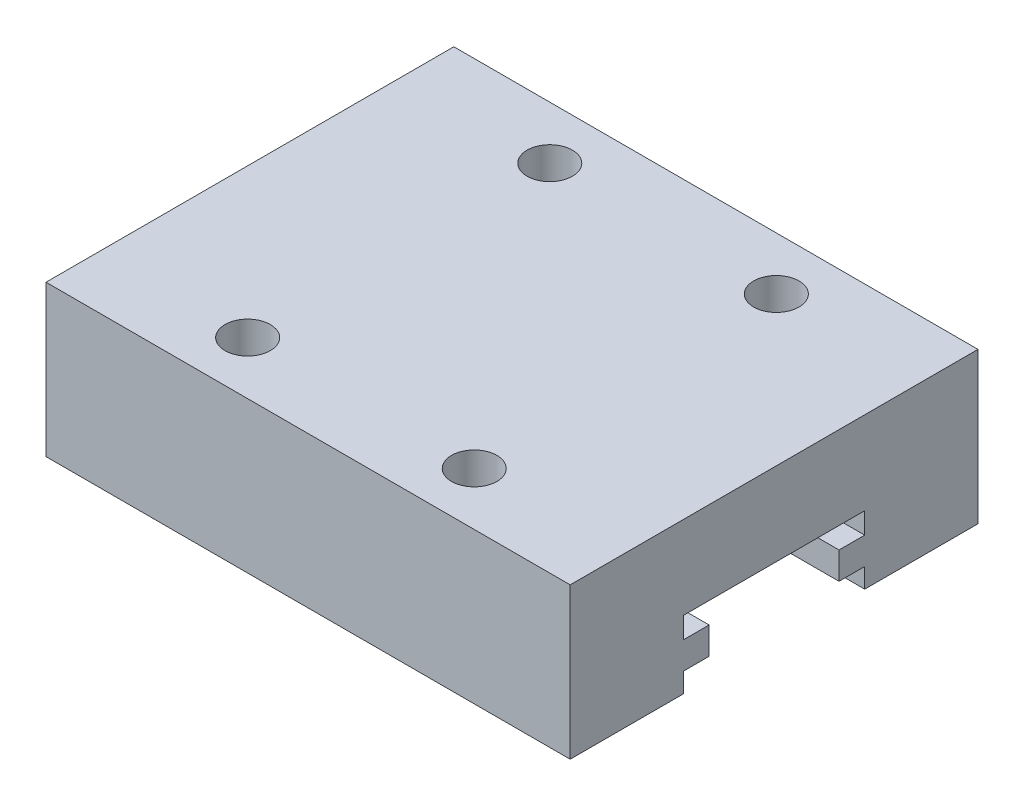
ISO-10303-21;
HEADER;
FILE_DESCRIPTION(('STEP AP214'),'2;1');
FILE_NAME('part.step','',(''),(''),'','','');
FILE_SCHEMA(('AUTOMOTIVE_DESIGN { 1 0 10303 214 1 1 1 1 }'));
ENDSEC;
DATA;
#1=APPLICATION_CONTEXT('core data for automotive mechanical design processes');
#2=APPLICATION_PROTOCOL_DEFINITION('international standard','automotive_design',2000,#1);
#3=PRODUCT_CONTEXT('',#1,'mechanical');
#4=PRODUCT('Part','Part','',(#3));
#5=PRODUCT_RELATED_PRODUCT_CATEGORY('part','',(#4));
#6=PRODUCT_DEFINITION_FORMATION('','',#4);
#7=PRODUCT_DEFINITION_CONTEXT('part definition',#1,'design');
#8=PRODUCT_DEFINITION('design','',#6,#7);
#9=PRODUCT_DEFINITION_SHAPE('','',#8);
#10=(LENGTH_UNIT() NAMED_UNIT(*) SI_UNIT(.MILLI.,.METRE.));
#11=(NAMED_UNIT(*) PLANE_ANGLE_UNIT() SI_UNIT($,.RADIAN.));
#12=(NAMED_UNIT(*) SI_UNIT($,.STERADIAN.) SOLID_ANGLE_UNIT());
#13=UNCERTAINTY_MEASURE_WITH_UNIT(LENGTH_MEASURE(1.E-05),#10,'distance_accuracy_value','');
#14=(GEOMETRIC_REPRESENTATION_CONTEXT(3) GLOBAL_UNCERTAINTY_ASSIGNED_CONTEXT((#13)) GLOBAL_UNIT_ASSIGNED_CONTEXT((#10,
#11,#12)) REPRESENTATION_CONTEXT('',''));
#15=CARTESIAN_POINT('',(0.,0.,0.));
#16=DIRECTION('',(0.,0.,1.));
#17=DIRECTION('',(1.,0.,0.));
#18=AXIS2_PLACEMENT_3D('',#15,#16,#17);
#19=CARTESIAN_POINT('',(0.,0.,0.));
#20=DIRECTION('',(0.,-1.,0.));
#21=DIRECTION('',(0.,0.,-1.));
#22=AXIS2_PLACEMENT_3D('',#19,#20,#21);
#23=PLANE('',#22);
#24=DIRECTION('',(1.,0.,0.));
#25=VECTOR('',#24,1.);
#26=CARTESIAN_POINT('',(-12.8160056179763,0.,-7.5));
#27=LINE('',#26,#25);
#28=CARTESIAN_POINT('',(0.,0.,-7.5));
#29=VERTEX_POINT('',#28);
#30=CARTESIAN_POINT('',(34.7,0.,-7.5));
#31=VERTEX_POINT('',#30);
#32=EDGE_CURVE('E159',#29,#31,#27,.T.);
#33=ORIENTED_EDGE('',*,*,#32,.T.);
#34=DIRECTION('',(0.,0.,-1.));
#35=VECTOR('',#34,1.);
#36=CARTESIAN_POINT('',(34.7,0.,0.));
#37=LINE('',#36,#35);
#38=CARTESIAN_POINT('',(34.7,0.,0.));
#39=VERTEX_POINT('',#38);
#40=EDGE_CURVE('E173',#39,#31,#37,.T.);
#41=ORIENTED_EDGE('',*,*,#40,.F.);
#42=DIRECTION('',(1.,0.,0.));
#43=VECTOR('',#42,1.);
#44=CARTESIAN_POINT('',(0.,0.,0.));
#45=LINE('',#44,#43);
#46=CARTESIAN_POINT('',(0.,0.,0.));
#47=VERTEX_POINT('',#46);
#48=EDGE_CURVE('E185',#47,#39,#45,.T.);
#49=ORIENTED_EDGE('',*,*,#48,.F.);
#50=DIRECTION('',(0.,0.,1.));
#51=VECTOR('',#50,1.);
#52=CARTESIAN_POINT('',(0.,0.,0.));
#53=LINE('',#52,#51);
#54=EDGE_CURVE('E174',#29,#47,#53,.T.);
#55=ORIENTED_EDGE('',*,*,#54,.F.);
#56=EDGE_LOOP('',(#33,#41,#49,#55));
#57=FACE_BOUND('',#56,.T.);
#58=ADVANCED_FACE('F34',(#57),#23,.T.);
#59=CARTESIAN_POINT('',(0.,10.,0.));
#60=DIRECTION('',(1.,0.,0.));
#61=DIRECTION('',(0.,0.,-1.));
#62=AXIS2_PLACEMENT_3D('',#59,#60,#61);
#63=PLANE('',#62);
#64=DIRECTION('',(0.,0.,-1.));
#65=VECTOR('',#64,1.);
#66=CARTESIAN_POINT('',(0.,1.3,-7.5));
#67=LINE('',#66,#65);
#68=CARTESIAN_POINT('',(0.,1.3,-7.5));
#69=VERTEX_POINT('',#68);
#70=CARTESIAN_POINT('',(0.,1.3,-9.2));
#71=VERTEX_POINT('',#70);
#72=EDGE_CURVE('E280',#69,#71,#67,.T.);
#73=ORIENTED_EDGE('',*,*,#72,.F.);
#74=DIRECTION('',(0.,1.,0.));
#75=VECTOR('',#74,1.);
#76=CARTESIAN_POINT('',(0.,0.,-7.5));
#77=LINE('',#76,#75);
#78=EDGE_CURVE('E229',#29,#69,#77,.T.);
#79=ORIENTED_EDGE('',*,*,#78,.F.);
#80=ORIENTED_EDGE('',*,*,#54,.T.);
#81=DIRECTION('',(0.,-1.,0.));
#82=VECTOR('',#81,1.);
#83=CARTESIAN_POINT('',(0.,10.,0.));
#84=LINE('',#83,#82);
#85=CARTESIAN_POINT('',(0.,10.,0.));
#86=VERTEX_POINT('',#85);
#87=EDGE_CURVE('E11',#86,#47,#84,.T.);
#88=ORIENTED_EDGE('',*,*,#87,.F.);
#89=DIRECTION('',(0.,0.,1.));
#90=VECTOR('',#89,1.);
#91=CARTESIAN_POINT('',(0.,10.,0.));
#92=LINE('',#91,#90);
#93=CARTESIAN_POINT('',(0.,10.,-27.));
#94=VERTEX_POINT('',#93);
#95=EDGE_CURVE('E183',#94,#86,#92,.T.);
#96=ORIENTED_EDGE('',*,*,#95,.F.);
#97=DIRECTION('',(0.,-1.,0.));
#98=VECTOR('',#97,1.);
#99=CARTESIAN_POINT('',(0.,10.,-27.));
#100=LINE('',#99,#98);
#101=CARTESIAN_POINT('',(0.,0.,-27.));
#102=VERTEX_POINT('',#101);
#103=EDGE_CURVE('E189',#94,#102,#100,.T.);
#104=ORIENTED_EDGE('',*,*,#103,.T.);
#105=CARTESIAN_POINT('',(0.,0.,-19.5));
#106=VERTEX_POINT('',#105);
#107=EDGE_CURVE('E199',#102,#106,#53,.T.);
#108=ORIENTED_EDGE('',*,*,#107,.T.);
#109=DIRECTION('',(0.,-1.,0.));
#110=VECTOR('',#109,1.);
#111=CARTESIAN_POINT('',(0.,0.,-19.5));
#112=LINE('',#111,#110);
#113=CARTESIAN_POINT('',(0.,1.3,-19.5));
#114=VERTEX_POINT('',#113);
#115=EDGE_CURVE('E49',#114,#106,#112,.T.);
#116=ORIENTED_EDGE('',*,*,#115,.F.);
#117=DIRECTION('',(0.,0.,-1.));
#118=VECTOR('',#117,1.);
#119=CARTESIAN_POINT('',(0.,1.3,-19.5));
#120=LINE('',#119,#118);
#121=CARTESIAN_POINT('',(0.,1.3,-17.8));
#122=VERTEX_POINT('',#121);
#123=EDGE_CURVE('E296',#122,#114,#120,.T.);
#124=ORIENTED_EDGE('',*,*,#123,.F.);
#125=DIRECTION('',(0.,-1.,0.));
#126=VECTOR('',#125,1.);
#127=CARTESIAN_POINT('',(0.,3.1,-17.8));
#128=LINE('',#127,#126);
#129=CARTESIAN_POINT('',(0.,3.1,-17.8));
#130=VERTEX_POINT('',#129);
#131=EDGE_CURVE('E294',#130,#122,#128,.T.);
#132=ORIENTED_EDGE('',*,*,#131,.F.);
#133=DIRECTION('',(0.,0.,1.));
#134=VECTOR('',#133,1.);
#135=CARTESIAN_POINT('',(0.,3.1,-19.5));
#136=LINE('',#135,#134);
#137=CARTESIAN_POINT('',(0.,3.1,-19.5));
#138=VERTEX_POINT('',#137);
#139=EDGE_CURVE('E292',#138,#130,#136,.T.);
#140=ORIENTED_EDGE('',*,*,#139,.F.);
#141=DIRECTION('',(0.,-1.,0.));
#142=VECTOR('',#141,1.);
#143=CARTESIAN_POINT('',(0.,3.1,-19.5));
#144=LINE('',#143,#142);
#145=CARTESIAN_POINT('',(0.,4.5,-19.5));
#146=VERTEX_POINT('',#145);
#147=EDGE_CURVE('E290',#146,#138,#144,.T.);
#148=ORIENTED_EDGE('',*,*,#147,.F.);
#149=DIRECTION('',(0.,0.,-1.));
#150=VECTOR('',#149,1.);
#151=CARTESIAN_POINT('',(0.,4.5,-7.5));
#152=LINE('',#151,#150);
#153=CARTESIAN_POINT('',(0.,4.5,-7.5));
#154=VERTEX_POINT('',#153);
#155=EDGE_CURVE('E288',#154,#146,#152,.T.);
#156=ORIENTED_EDGE('',*,*,#155,.F.);
#157=DIRECTION('',(0.,1.,0.));
#158=VECTOR('',#157,1.);
#159=CARTESIAN_POINT('',(0.,3.1,-7.5));
#160=LINE('',#159,#158);
#161=CARTESIAN_POINT('',(0.,3.1,-7.5));
#162=VERTEX_POINT('',#161);
#163=EDGE_CURVE('E286',#162,#154,#160,.T.);
#164=ORIENTED_EDGE('',*,*,#163,.F.);
#165=DIRECTION('',(0.,0.,1.));
#166=VECTOR('',#165,1.);
#167=CARTESIAN_POINT('',(0.,3.1,-7.5));
#168=LINE('',#167,#166);
#169=CARTESIAN_POINT('',(0.,3.1,-9.2));
#170=VERTEX_POINT('',#169);
#171=EDGE_CURVE('E284',#170,#162,#168,.T.);
#172=ORIENTED_EDGE('',*,*,#171,.F.);
#173=DIRECTION('',(0.,1.,0.));
#174=VECTOR('',#173,1.);
#175=CARTESIAN_POINT('',(0.,3.1,-9.2));
#176=LINE('',#175,#174);
#177=EDGE_CURVE('E282',#71,#170,#176,.T.);
#178=ORIENTED_EDGE('',*,*,#177,.F.);
#179=EDGE_LOOP('',(#73,#79,#80,#88,#96,#104,#108,#116,#124,#132,#140,#148,#156,#164,#172,#178));
#180=FACE_BOUND('',#179,.T.);
#181=ADVANCED_FACE('F36',(#180),#63,.F.);
#182=CARTESIAN_POINT('',(0.,10.,0.));
#183=DIRECTION('',(0.,0.,-1.));
#184=DIRECTION('',(-1.,0.,0.));
#185=AXIS2_PLACEMENT_3D('',#182,#183,#184);
#186=PLANE('',#185);
#187=ORIENTED_EDGE('',*,*,#48,.T.);
#188=DIRECTION('',(0.,-1.,0.));
#189=VECTOR('',#188,1.);
#190=CARTESIAN_POINT('',(34.7,10.,0.));
#191=LINE('',#190,#189);
#192=CARTESIAN_POINT('',(34.7,10.,0.));
#193=VERTEX_POINT('',#192);
#194=EDGE_CURVE('E42',#193,#39,#191,.T.);
#195=ORIENTED_EDGE('',*,*,#194,.F.);
#196=DIRECTION('',(1.,0.,0.));
#197=VECTOR('',#196,1.);
#198=CARTESIAN_POINT('',(0.,10.,0.));
#199=LINE('',#198,#197);
#200=EDGE_CURVE('E86',#86,#193,#199,.T.);
#201=ORIENTED_EDGE('',*,*,#200,.F.);
#202=ORIENTED_EDGE('',*,*,#87,.T.);
#203=EDGE_LOOP('',(#187,#195,#201,#202));
#204=FACE_BOUND('',#203,.T.);
#205=ADVANCED_FACE('F309',(#204),#186,.F.);
#206=CARTESIAN_POINT('',(34.7,10.,0.));
#207=DIRECTION('',(-1.,0.,0.));
#208=DIRECTION('',(0.,0.,1.));
#209=AXIS2_PLACEMENT_3D('',#206,#207,#208);
#210=PLANE('',#209);
#211=ORIENTED_EDGE('',*,*,#40,.T.);
#212=DIRECTION('',(0.,-1.,0.));
#213=VECTOR('',#212,1.);
#214=CARTESIAN_POINT('',(34.7,0.,-7.5));
#215=LINE('',#214,#213);
#216=CARTESIAN_POINT('',(34.7,1.3,-7.5));
#217=VERTEX_POINT('',#216);
#218=EDGE_CURVE('E156',#217,#31,#215,.T.);
#219=ORIENTED_EDGE('',*,*,#218,.F.);
#220=DIRECTION('',(0.,0.,1.));
#221=VECTOR('',#220,1.);
#222=CARTESIAN_POINT('',(34.7,1.3,-7.5));
#223=LINE('',#222,#221);
#224=CARTESIAN_POINT('',(34.7,1.3,-9.2));
#225=VERTEX_POINT('',#224);
#226=EDGE_CURVE('E176',#225,#217,#223,.T.);
#227=ORIENTED_EDGE('',*,*,#226,.F.);
#228=DIRECTION('',(0.,-1.,0.));
#229=VECTOR('',#228,1.);
#230=CARTESIAN_POINT('',(34.7,3.1,-9.2));
#231=LINE('',#230,#229);
#232=CARTESIAN_POINT('',(34.7,3.1,-9.2));
#233=VERTEX_POINT('',#232);
#234=EDGE_CURVE('E253',#233,#225,#231,.T.);
#235=ORIENTED_EDGE('',*,*,#234,.F.);
#236=DIRECTION('',(0.,0.,-1.));
#237=VECTOR('',#236,1.);
#238=CARTESIAN_POINT('',(34.7,3.1,-7.5));
#239=LINE('',#238,#237);
#240=CARTESIAN_POINT('',(34.7,3.1,-7.5));
#241=VERTEX_POINT('',#240);
#242=EDGE_CURVE('E256',#241,#233,#239,.T.);
#243=ORIENTED_EDGE('',*,*,#242,.F.);
#244=DIRECTION('',(0.,-1.,0.));
#245=VECTOR('',#244,1.);
#246=CARTESIAN_POINT('',(34.7,3.1,-7.5));
#247=LINE('',#246,#245);
#248=CARTESIAN_POINT('',(34.7,4.5,-7.5));
#249=VERTEX_POINT('',#248);
#250=EDGE_CURVE('E259',#249,#241,#247,.T.);
#251=ORIENTED_EDGE('',*,*,#250,.F.);
#252=DIRECTION('',(0.,0.,1.));
#253=VECTOR('',#252,1.);
#254=CARTESIAN_POINT('',(34.7,4.5,-7.5));
#255=LINE('',#254,#253);
#256=CARTESIAN_POINT('',(34.7,4.5,-19.5));
#257=VERTEX_POINT('',#256);
#258=EDGE_CURVE('E262',#257,#249,#255,.T.);
#259=ORIENTED_EDGE('',*,*,#258,.F.);
#260=DIRECTION('',(0.,1.,0.));
#261=VECTOR('',#260,1.);
#262=CARTESIAN_POINT('',(34.7,3.1,-19.5));
#263=LINE('',#262,#261);
#264=CARTESIAN_POINT('',(34.7,3.1,-19.5));
#265=VERTEX_POINT('',#264);
#266=EDGE_CURVE('E265',#265,#257,#263,.T.);
#267=ORIENTED_EDGE('',*,*,#266,.F.);
#268=DIRECTION('',(0.,0.,-1.));
#269=VECTOR('',#268,1.);
#270=CARTESIAN_POINT('',(34.7,3.1,-19.5));
#271=LINE('',#270,#269);
#272=CARTESIAN_POINT('',(34.7,3.1,-17.8));
#273=VERTEX_POINT('',#272);
#274=EDGE_CURVE('E268',#273,#265,#271,.T.);
#275=ORIENTED_EDGE('',*,*,#274,.F.);
#276=DIRECTION('',(0.,1.,0.));
#277=VECTOR('',#276,1.);
#278=CARTESIAN_POINT('',(34.7,3.1,-17.8));
#279=LINE('',#278,#277);
#280=CARTESIAN_POINT('',(34.7,1.3,-17.8));
#281=VERTEX_POINT('',#280);
#282=EDGE_CURVE('E271',#281,#273,#279,.T.);
#283=ORIENTED_EDGE('',*,*,#282,.F.);
#284=DIRECTION('',(0.,0.,1.));
#285=VECTOR('',#284,1.);
#286=CARTESIAN_POINT('',(34.7,1.3,-19.5));
#287=LINE('',#286,#285);
#288=CARTESIAN_POINT('',(34.7,1.3,-19.5));
#289=VERTEX_POINT('',#288);
#290=EDGE_CURVE('E274',#289,#281,#287,.T.);
#291=ORIENTED_EDGE('',*,*,#290,.F.);
#292=DIRECTION('',(0.,1.,0.));
#293=VECTOR('',#292,1.);
#294=CARTESIAN_POINT('',(34.7,0.,-19.5));
#295=LINE('',#294,#293);
#296=CARTESIAN_POINT('',(34.7,0.,-19.5));
#297=VERTEX_POINT('',#296);
#298=EDGE_CURVE('E167',#297,#289,#295,.T.);
#299=ORIENTED_EDGE('',*,*,#298,.F.);
#300=CARTESIAN_POINT('',(34.7,0.,-27.));
#301=VERTEX_POINT('',#300);
#302=EDGE_CURVE('E181',#297,#301,#37,.T.);
#303=ORIENTED_EDGE('',*,*,#302,.T.);
#304=DIRECTION('',(0.,-1.,0.));
#305=VECTOR('',#304,1.);
#306=CARTESIAN_POINT('',(34.7,10.,-27.));
#307=LINE('',#306,#305);
#308=CARTESIAN_POINT('',(34.7,10.,-27.));
#309=VERTEX_POINT('',#308);
#310=EDGE_CURVE('E191',#309,#301,#307,.T.);
#311=ORIENTED_EDGE('',*,*,#310,.F.);
#312=DIRECTION('',(0.,0.,-1.));
#313=VECTOR('',#312,1.);
#314=CARTESIAN_POINT('',(34.7,10.,0.));
#315=LINE('',#314,#313);
#316=EDGE_CURVE('E204',#193,#309,#315,.T.);
#317=ORIENTED_EDGE('',*,*,#316,.F.);
#318=ORIENTED_EDGE('',*,*,#194,.T.);
#319=EDGE_LOOP('',(#211,#219,#227,#235,#243,#251,#259,#267,#275,#283,#291,#299,#303,#311,#317,#318));
#320=FACE_BOUND('',#319,.T.);
#321=ADVANCED_FACE('F179',(#320),#210,.F.);
#322=CARTESIAN_POINT('',(0.,10.,-27.));
#323=DIRECTION('',(0.,0.,1.));
#324=DIRECTION('',(1.,0.,0.));
#325=AXIS2_PLACEMENT_3D('',#322,#323,#324);
#326=PLANE('',#325);
#327=DIRECTION('',(-1.,0.,0.));
#328=VECTOR('',#327,1.);
#329=CARTESIAN_POINT('',(0.,0.,-27.));
#330=LINE('',#329,#328);
#331=EDGE_CURVE('E79',#301,#102,#330,.T.);
#332=ORIENTED_EDGE('',*,*,#331,.T.);
#333=ORIENTED_EDGE('',*,*,#103,.F.);
#334=DIRECTION('',(-1.,0.,0.));
#335=VECTOR('',#334,1.);
#336=CARTESIAN_POINT('',(0.,10.,-27.));
#337=LINE('',#336,#335);
#338=EDGE_CURVE('E58',#309,#94,#337,.T.);
#339=ORIENTED_EDGE('',*,*,#338,.F.);
#340=ORIENTED_EDGE('',*,*,#310,.T.);
#341=EDGE_LOOP('',(#332,#333,#339,#340));
#342=FACE_BOUND('',#341,.T.);
#343=ADVANCED_FACE('F193',(#342),#326,.F.);
#344=CARTESIAN_POINT('',(0.,10.,0.));
#345=DIRECTION('',(0.,-1.,0.));
#346=DIRECTION('',(0.,0.,-1.));
#347=AXIS2_PLACEMENT_3D('',#344,#345,#346);
#348=PLANE('',#347);
#349=CARTESIAN_POINT('',(24.8499864669187,10.,-23.5000000000026));
#350=DIRECTION('',(0.,1.,0.));
#351=DIRECTION('',(0.,0.,1.));
#352=AXIS2_PLACEMENT_3D('',#349,#350,#351);
#353=CIRCLE('',#352,1.49999999999925);
#354=CARTESIAN_POINT('',(24.8499864669187,10.,-22.0000000000033));
#355=VERTEX_POINT('',#354);
#356=EDGE_CURVE('E221',#355,#355,#353,.T.);
#357=ORIENTED_EDGE('',*,*,#356,.F.);
#358=EDGE_LOOP('',(#357));
#359=FACE_BOUND('',#358,.T.);
#360=CARTESIAN_POINT('',(9.85,10.,-3.5));
#361=DIRECTION('',(0.,1.,0.));
#362=DIRECTION('',(0.,0.,1.));
#363=AXIS2_PLACEMENT_3D('',#360,#361,#362);
#364=CIRCLE('',#363,1.5);
#365=CARTESIAN_POINT('',(9.85,10.,-2.));
#366=VERTEX_POINT('',#365);
#367=EDGE_CURVE('E214',#366,#366,#364,.T.);
#368=ORIENTED_EDGE('',*,*,#367,.F.);
#369=EDGE_LOOP('',(#368));
#370=FACE_BOUND('',#369,.T.);
#371=CARTESIAN_POINT('',(24.8499864669187,10.,-3.5));
#372=DIRECTION('',(0.,1.,0.));
#373=DIRECTION('',(0.,0.,1.));
#374=AXIS2_PLACEMENT_3D('',#371,#372,#373);
#375=CIRCLE('',#374,1.5);
#376=CARTESIAN_POINT('',(24.8499864669187,10.,-2.));
#377=VERTEX_POINT('',#376);
#378=EDGE_CURVE('E226',#377,#377,#375,.T.);
#379=ORIENTED_EDGE('',*,*,#378,.F.);
#380=EDGE_LOOP('',(#379));
#381=FACE_BOUND('',#380,.T.);
#382=CARTESIAN_POINT('',(9.84999999999999,10.,-23.5));
#383=DIRECTION('',(0.,1.,0.));
#384=DIRECTION('',(0.,0.,1.));
#385=AXIS2_PLACEMENT_3D('',#382,#383,#384);
#386=CIRCLE('',#385,1.50000000000001);
#387=CARTESIAN_POINT('',(9.84999999999999,10.,-22.));
#388=VERTEX_POINT('',#387);
#389=EDGE_CURVE('E208',#388,#388,#386,.T.);
#390=ORIENTED_EDGE('',*,*,#389,.F.);
#391=EDGE_LOOP('',(#390));
#392=FACE_BOUND('',#391,.T.);
#393=ORIENTED_EDGE('',*,*,#95,.T.);
#394=ORIENTED_EDGE('',*,*,#200,.T.);
#395=ORIENTED_EDGE('',*,*,#316,.T.);
#396=ORIENTED_EDGE('',*,*,#338,.T.);
#397=EDGE_LOOP('',(#393,#394,#395,#396));
#398=FACE_BOUND('',#397,.T.);
#399=ADVANCED_FACE('F321',(#359,#370,#381,#392,#398),#348,.F.);
#400=DIRECTION('',(1.,0.,0.));
#401=VECTOR('',#400,1.);
#402=CARTESIAN_POINT('',(-12.8160056179763,0.,-19.5));
#403=LINE('',#402,#401);
#404=EDGE_CURVE('E175',#106,#297,#403,.T.);
#405=ORIENTED_EDGE('',*,*,#404,.F.);
#406=ORIENTED_EDGE('',*,*,#107,.F.);
#407=ORIENTED_EDGE('',*,*,#331,.F.);
#408=ORIENTED_EDGE('',*,*,#302,.F.);
#409=EDGE_LOOP('',(#405,#406,#407,#408));
#410=FACE_BOUND('',#409,.T.);
#411=ADVANCED_FACE('F197',(#410),#23,.T.);
#412=CARTESIAN_POINT('',(9.84999999999999,5.,-23.5));
#413=DIRECTION('',(0.,1.,0.));
#414=DIRECTION('',(0.,0.,1.));
#415=AXIS2_PLACEMENT_3D('',#412,#413,#414);
#416=CYLINDRICAL_SURFACE('',#415,1.50000000000001);
#417=CARTESIAN_POINT('',(9.84999999999999,5.,-23.5));
#418=DIRECTION('',(0.,1.,0.));
#419=DIRECTION('',(0.,0.,1.));
#420=AXIS2_PLACEMENT_3D('',#417,#418,#419);
#421=CIRCLE('',#420,1.50000000000001);
#422=CARTESIAN_POINT('',(9.84999999999999,5.,-22.));
#423=VERTEX_POINT('',#422);
#424=EDGE_CURVE('E201',#423,#423,#421,.T.);
#425=ORIENTED_EDGE('',*,*,#424,.F.);
#426=EDGE_LOOP('',(#425));
#427=FACE_BOUND('',#426,.T.);
#428=ORIENTED_EDGE('',*,*,#389,.T.);
#429=EDGE_LOOP('',(#428));
#430=FACE_BOUND('',#429,.T.);
#431=ADVANCED_FACE('F320',(#427,#430),#416,.F.);
#432=CARTESIAN_POINT('',(9.84999999999999,5.,-23.5));
#433=DIRECTION('',(0.,1.,0.));
#434=DIRECTION('',(0.,0.,1.));
#435=AXIS2_PLACEMENT_3D('',#432,#433,#434);
#436=PLANE('',#435);
#437=ORIENTED_EDGE('',*,*,#424,.T.);
#438=EDGE_LOOP('',(#437));
#439=FACE_BOUND('',#438,.T.);
#440=ADVANCED_FACE('F326',(#439),#436,.T.);
#441=CARTESIAN_POINT('',(24.8499864669187,5.,-3.5));
#442=DIRECTION('',(0.,1.,0.));
#443=DIRECTION('',(0.,0.,1.));
#444=AXIS2_PLACEMENT_3D('',#441,#442,#443);
#445=CYLINDRICAL_SURFACE('',#444,1.5);
#446=CARTESIAN_POINT('',(24.8499864669187,5.,-3.5));
#447=DIRECTION('',(0.,1.,0.));
#448=DIRECTION('',(0.,0.,1.));
#449=AXIS2_PLACEMENT_3D('',#446,#447,#448);
#450=CIRCLE('',#449,1.5);
#451=CARTESIAN_POINT('',(24.8499864669187,5.,-2.));
#452=VERTEX_POINT('',#451);
#453=EDGE_CURVE('E218',#452,#452,#450,.T.);
#454=ORIENTED_EDGE('',*,*,#453,.F.);
#455=EDGE_LOOP('',(#454));
#456=FACE_BOUND('',#455,.T.);
#457=ORIENTED_EDGE('',*,*,#378,.T.);
#458=EDGE_LOOP('',(#457));
#459=FACE_BOUND('',#458,.T.);
#460=ADVANCED_FACE('F338',(#456,#459),#445,.F.);
#461=CARTESIAN_POINT('',(24.8499864669187,5.,-3.5));
#462=DIRECTION('',(0.,1.,0.));
#463=DIRECTION('',(0.,0.,1.));
#464=AXIS2_PLACEMENT_3D('',#461,#462,#463);
#465=PLANE('',#464);
#466=ORIENTED_EDGE('',*,*,#453,.T.);
#467=EDGE_LOOP('',(#466));
#468=FACE_BOUND('',#467,.T.);
#469=ADVANCED_FACE('F344',(#468),#465,.T.);
#470=CARTESIAN_POINT('',(9.85,5.,-3.5));
#471=DIRECTION('',(0.,1.,0.));
#472=DIRECTION('',(0.,0.,1.));
#473=AXIS2_PLACEMENT_3D('',#470,#471,#472);
#474=CYLINDRICAL_SURFACE('',#473,1.5);
#475=CARTESIAN_POINT('',(9.85,5.,-3.5));
#476=DIRECTION('',(0.,1.,0.));
#477=DIRECTION('',(0.,0.,1.));
#478=AXIS2_PLACEMENT_3D('',#475,#476,#477);
#479=CIRCLE('',#478,1.5);
#480=CARTESIAN_POINT('',(9.85,5.,-2.));
#481=VERTEX_POINT('',#480);
#482=EDGE_CURVE('E217',#481,#481,#479,.T.);
#483=ORIENTED_EDGE('',*,*,#482,.F.);
#484=EDGE_LOOP('',(#483));
#485=FACE_BOUND('',#484,.T.);
#486=ORIENTED_EDGE('',*,*,#367,.T.);
#487=EDGE_LOOP('',(#486));
#488=FACE_BOUND('',#487,.T.);
#489=ADVANCED_FACE('F340',(#485,#488),#474,.F.);
#490=CARTESIAN_POINT('',(9.85,5.,-3.5));
#491=DIRECTION('',(0.,1.,0.));
#492=DIRECTION('',(0.,0.,1.));
#493=AXIS2_PLACEMENT_3D('',#490,#491,#492);
#494=PLANE('',#493);
#495=ORIENTED_EDGE('',*,*,#482,.T.);
#496=EDGE_LOOP('',(#495));
#497=FACE_BOUND('',#496,.T.);
#498=ADVANCED_FACE('F343',(#497),#494,.T.);
#499=CARTESIAN_POINT('',(24.8499864669187,5.,-23.5000000000026));
#500=DIRECTION('',(0.,1.,0.));
#501=DIRECTION('',(0.,0.,1.));
#502=AXIS2_PLACEMENT_3D('',#499,#500,#501);
#503=CYLINDRICAL_SURFACE('',#502,1.49999999999925);
#504=CARTESIAN_POINT('',(24.8499864669187,5.,-23.5000000000026));
#505=DIRECTION('',(0.,1.,0.));
#506=DIRECTION('',(0.,0.,1.));
#507=AXIS2_PLACEMENT_3D('',#504,#505,#506);
#508=CIRCLE('',#507,1.49999999999925);
#509=CARTESIAN_POINT('',(24.8499864669187,5.,-22.0000000000033));
#510=VERTEX_POINT('',#509);
#511=EDGE_CURVE('E211',#510,#510,#508,.T.);
#512=ORIENTED_EDGE('',*,*,#511,.F.);
#513=EDGE_LOOP('',(#512));
#514=FACE_BOUND('',#513,.T.);
#515=ORIENTED_EDGE('',*,*,#356,.T.);
#516=EDGE_LOOP('',(#515));
#517=FACE_BOUND('',#516,.T.);
#518=ADVANCED_FACE('F348',(#514,#517),#503,.F.);
#519=CARTESIAN_POINT('',(24.8499864669187,5.,-23.5000000000026));
#520=DIRECTION('',(0.,1.,0.));
#521=DIRECTION('',(0.,0.,1.));
#522=AXIS2_PLACEMENT_3D('',#519,#520,#521);
#523=PLANE('',#522);
#524=ORIENTED_EDGE('',*,*,#511,.T.);
#525=EDGE_LOOP('',(#524));
#526=FACE_BOUND('',#525,.T.);
#527=ADVANCED_FACE('F352',(#526),#523,.T.);
#528=CARTESIAN_POINT('',(-12.8160056179763,0.,-7.5));
#529=DIRECTION('',(0.,0.,1.));
#530=DIRECTION('',(0.,-1.,0.));
#531=AXIS2_PLACEMENT_3D('',#528,#529,#530);
#532=PLANE('',#531);
#533=ORIENTED_EDGE('',*,*,#78,.T.);
#534=DIRECTION('',(1.,0.,0.));
#535=VECTOR('',#534,1.);
#536=CARTESIAN_POINT('',(-12.8160056179763,1.3,-7.5));
#537=LINE('',#536,#535);
#538=EDGE_CURVE('E162',#69,#217,#537,.T.);
#539=ORIENTED_EDGE('',*,*,#538,.T.);
#540=ORIENTED_EDGE('',*,*,#218,.T.);
#541=ORIENTED_EDGE('',*,*,#32,.F.);
#542=EDGE_LOOP('',(#533,#539,#540,#541));
#543=FACE_BOUND('',#542,.T.);
#544=ADVANCED_FACE('F158',(#543),#532,.F.);
#545=CARTESIAN_POINT('',(-12.8160056179763,1.3,-7.5));
#546=DIRECTION('',(0.,1.,0.));
#547=DIRECTION('',(0.,0.,1.));
#548=AXIS2_PLACEMENT_3D('',#545,#546,#547);
#549=PLANE('',#548);
#550=ORIENTED_EDGE('',*,*,#72,.T.);
#551=DIRECTION('',(1.,0.,0.));
#552=VECTOR('',#551,1.);
#553=CARTESIAN_POINT('',(-12.8160056179763,1.3,-9.2));
#554=LINE('',#553,#552);
#555=EDGE_CURVE('E249',#71,#225,#554,.T.);
#556=ORIENTED_EDGE('',*,*,#555,.T.);
#557=ORIENTED_EDGE('',*,*,#226,.T.);
#558=ORIENTED_EDGE('',*,*,#538,.F.);
#559=EDGE_LOOP('',(#550,#556,#557,#558));
#560=FACE_BOUND('',#559,.T.);
#561=ADVANCED_FACE('F365',(#560),#549,.F.);
#562=CARTESIAN_POINT('',(-12.8160056179763,3.1,-9.2));
#563=DIRECTION('',(0.,0.,1.));
#564=DIRECTION('',(0.,-1.,0.));
#565=AXIS2_PLACEMENT_3D('',#562,#563,#564);
#566=PLANE('',#565);
#567=ORIENTED_EDGE('',*,*,#177,.T.);
#568=DIRECTION('',(1.,0.,0.));
#569=VECTOR('',#568,1.);
#570=CARTESIAN_POINT('',(-12.8160056179763,3.1,-9.2));
#571=LINE('',#570,#569);
#572=EDGE_CURVE('E247',#170,#233,#571,.T.);
#573=ORIENTED_EDGE('',*,*,#572,.T.);
#574=ORIENTED_EDGE('',*,*,#234,.T.);
#575=ORIENTED_EDGE('',*,*,#555,.F.);
#576=EDGE_LOOP('',(#567,#573,#574,#575));
#577=FACE_BOUND('',#576,.T.);
#578=ADVANCED_FACE('F393',(#577),#566,.F.);
#579=CARTESIAN_POINT('',(-12.8160056179763,3.1,-7.5));
#580=DIRECTION('',(0.,-1.,0.));
#581=DIRECTION('',(0.,0.,-1.));
#582=AXIS2_PLACEMENT_3D('',#579,#580,#581);
#583=PLANE('',#582);
#584=ORIENTED_EDGE('',*,*,#171,.T.);
#585=DIRECTION('',(1.,0.,0.));
#586=VECTOR('',#585,1.);
#587=CARTESIAN_POINT('',(-12.8160056179763,3.1,-7.5));
#588=LINE('',#587,#586);
#589=EDGE_CURVE('E245',#162,#241,#588,.T.);
#590=ORIENTED_EDGE('',*,*,#589,.T.);
#591=ORIENTED_EDGE('',*,*,#242,.T.);
#592=ORIENTED_EDGE('',*,*,#572,.F.);
#593=EDGE_LOOP('',(#584,#590,#591,#592));
#594=FACE_BOUND('',#593,.T.);
#595=ADVANCED_FACE('F389',(#594),#583,.F.);
#596=CARTESIAN_POINT('',(-12.8160056179763,3.1,-7.5));
#597=DIRECTION('',(0.,0.,1.));
#598=DIRECTION('',(0.,-1.,0.));
#599=AXIS2_PLACEMENT_3D('',#596,#597,#598);
#600=PLANE('',#599);
#601=ORIENTED_EDGE('',*,*,#163,.T.);
#602=DIRECTION('',(1.,0.,0.));
#603=VECTOR('',#602,1.);
#604=CARTESIAN_POINT('',(-12.8160056179763,4.5,-7.5));
#605=LINE('',#604,#603);
#606=EDGE_CURVE('E243',#154,#249,#605,.T.);
#607=ORIENTED_EDGE('',*,*,#606,.T.);
#608=ORIENTED_EDGE('',*,*,#250,.T.);
#609=ORIENTED_EDGE('',*,*,#589,.F.);
#610=EDGE_LOOP('',(#601,#607,#608,#609));
#611=FACE_BOUND('',#610,.T.);
#612=ADVANCED_FACE('F385',(#611),#600,.F.);
#613=CARTESIAN_POINT('',(-12.8160056179763,4.5,-7.5));
#614=DIRECTION('',(0.,1.,0.));
#615=DIRECTION('',(0.,0.,1.));
#616=AXIS2_PLACEMENT_3D('',#613,#614,#615);
#617=PLANE('',#616);
#618=ORIENTED_EDGE('',*,*,#155,.T.);
#619=DIRECTION('',(1.,0.,0.));
#620=VECTOR('',#619,1.);
#621=CARTESIAN_POINT('',(-12.8160056179763,4.5,-19.5));
#622=LINE('',#621,#620);
#623=EDGE_CURVE('E241',#146,#257,#622,.T.);
#624=ORIENTED_EDGE('',*,*,#623,.T.);
#625=ORIENTED_EDGE('',*,*,#258,.T.);
#626=ORIENTED_EDGE('',*,*,#606,.F.);
#627=EDGE_LOOP('',(#618,#624,#625,#626));
#628=FACE_BOUND('',#627,.T.);
#629=ADVANCED_FACE('F381',(#628),#617,.F.);
#630=CARTESIAN_POINT('',(-12.8160056179763,3.1,-19.5));
#631=DIRECTION('',(0.,0.,-1.));
#632=DIRECTION('',(0.,1.,0.));
#633=AXIS2_PLACEMENT_3D('',#630,#631,#632);
#634=PLANE('',#633);
#635=ORIENTED_EDGE('',*,*,#147,.T.);
#636=DIRECTION('',(1.,0.,0.));
#637=VECTOR('',#636,1.);
#638=CARTESIAN_POINT('',(-12.8160056179763,3.1,-19.5));
#639=LINE('',#638,#637);
#640=EDGE_CURVE('E239',#138,#265,#639,.T.);
#641=ORIENTED_EDGE('',*,*,#640,.T.);
#642=ORIENTED_EDGE('',*,*,#266,.T.);
#643=ORIENTED_EDGE('',*,*,#623,.F.);
#644=EDGE_LOOP('',(#635,#641,#642,#643));
#645=FACE_BOUND('',#644,.T.);
#646=ADVANCED_FACE('F377',(#645),#634,.F.);
#647=CARTESIAN_POINT('',(-12.8160056179763,3.1,-19.5));
#648=DIRECTION('',(0.,-1.,0.));
#649=DIRECTION('',(0.,0.,-1.));
#650=AXIS2_PLACEMENT_3D('',#647,#648,#649);
#651=PLANE('',#650);
#652=ORIENTED_EDGE('',*,*,#139,.T.);
#653=DIRECTION('',(1.,0.,0.));
#654=VECTOR('',#653,1.);
#655=CARTESIAN_POINT('',(-12.8160056179763,3.1,-17.8));
#656=LINE('',#655,#654);
#657=EDGE_CURVE('E237',#130,#273,#656,.T.);
#658=ORIENTED_EDGE('',*,*,#657,.T.);
#659=ORIENTED_EDGE('',*,*,#274,.T.);
#660=ORIENTED_EDGE('',*,*,#640,.F.);
#661=EDGE_LOOP('',(#652,#658,#659,#660));
#662=FACE_BOUND('',#661,.T.);
#663=ADVANCED_FACE('F373',(#662),#651,.F.);
#664=CARTESIAN_POINT('',(-12.8160056179763,3.1,-17.8));
#665=DIRECTION('',(0.,0.,-1.));
#666=DIRECTION('',(0.,1.,0.));
#667=AXIS2_PLACEMENT_3D('',#664,#665,#666);
#668=PLANE('',#667);
#669=ORIENTED_EDGE('',*,*,#131,.T.);
#670=DIRECTION('',(1.,0.,0.));
#671=VECTOR('',#670,1.);
#672=CARTESIAN_POINT('',(-12.8160056179763,1.3,-17.8));
#673=LINE('',#672,#671);
#674=EDGE_CURVE('E235',#122,#281,#673,.T.);
#675=ORIENTED_EDGE('',*,*,#674,.T.);
#676=ORIENTED_EDGE('',*,*,#282,.T.);
#677=ORIENTED_EDGE('',*,*,#657,.F.);
#678=EDGE_LOOP('',(#669,#675,#676,#677));
#679=FACE_BOUND('',#678,.T.);
#680=ADVANCED_FACE('F370',(#679),#668,.F.);
#681=CARTESIAN_POINT('',(-12.8160056179763,1.3,-19.5));
#682=DIRECTION('',(0.,1.,0.));
#683=DIRECTION('',(0.,0.,1.));
#684=AXIS2_PLACEMENT_3D('',#681,#682,#683);
#685=PLANE('',#684);
#686=ORIENTED_EDGE('',*,*,#123,.T.);
#687=DIRECTION('',(1.,0.,0.));
#688=VECTOR('',#687,1.);
#689=CARTESIAN_POINT('',(-12.8160056179763,1.3,-19.5));
#690=LINE('',#689,#688);
#691=EDGE_CURVE('E233',#114,#289,#690,.T.);
#692=ORIENTED_EDGE('',*,*,#691,.T.);
#693=ORIENTED_EDGE('',*,*,#290,.T.);
#694=ORIENTED_EDGE('',*,*,#674,.F.);
#695=EDGE_LOOP('',(#686,#692,#693,#694));
#696=FACE_BOUND('',#695,.T.);
#697=ADVANCED_FACE('F301',(#696),#685,.F.);
#698=CARTESIAN_POINT('',(-12.8160056179763,0.,-19.5));
#699=DIRECTION('',(0.,0.,-1.));
#700=DIRECTION('',(0.,1.,0.));
#701=AXIS2_PLACEMENT_3D('',#698,#699,#700);
#702=PLANE('',#701);
#703=ORIENTED_EDGE('',*,*,#115,.T.);
#704=ORIENTED_EDGE('',*,*,#404,.T.);
#705=ORIENTED_EDGE('',*,*,#298,.T.);
#706=ORIENTED_EDGE('',*,*,#691,.F.);
#707=EDGE_LOOP('',(#703,#704,#705,#706));
#708=FACE_BOUND('',#707,.T.);
#709=ADVANCED_FACE('F303',(#708),#702,.F.);
#710=CLOSED_SHELL('',(#58,#181,#205,#321,#343,#399,#411,#431,#440,#460,#469,#489,#498,#518,#527,
#544,#561,#578,#595,#612,#629,#646,#663,#680,#697,#709));
#711=MANIFOLD_SOLID_BREP('B2',#710);
#712=ADVANCED_BREP_SHAPE_REPRESENTATION('',(#18,#711),#14);
#713=SHAPE_DEFINITION_REPRESENTATION(#9,#712);
ENDSEC;
END-ISO-10303-21;
